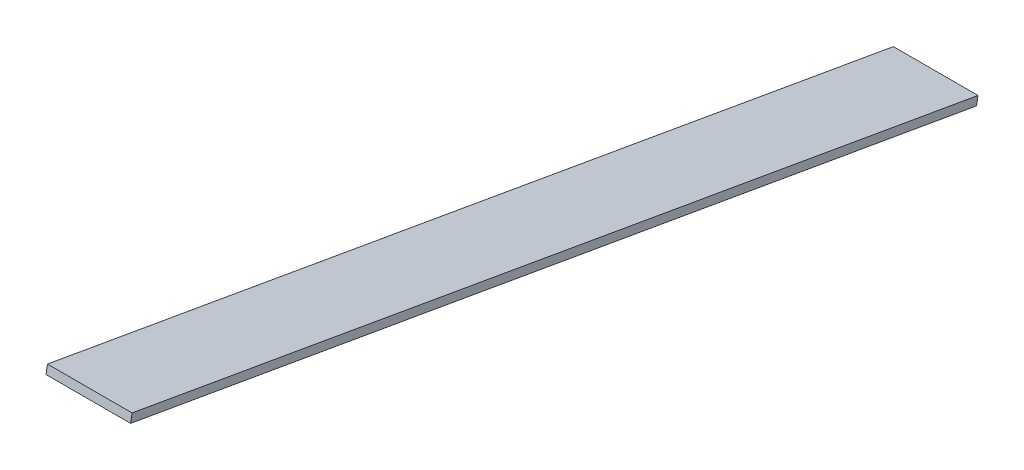
ISO-10303-21;
HEADER;
FILE_DESCRIPTION(('STEP AP214'),'2;1');
FILE_NAME('part.step','',(''),(''),'','','');
FILE_SCHEMA(('AUTOMOTIVE_DESIGN { 1 0 10303 214 1 1 1 1 }'));
ENDSEC;
DATA;
#1=APPLICATION_CONTEXT('core data for automotive mechanical design processes');
#2=APPLICATION_PROTOCOL_DEFINITION('international standard','automotive_design',2000,#1);
#3=PRODUCT_CONTEXT('',#1,'mechanical');
#4=PRODUCT('Part','Part','',(#3));
#5=PRODUCT_RELATED_PRODUCT_CATEGORY('part','',(#4));
#6=PRODUCT_DEFINITION_FORMATION('','',#4);
#7=PRODUCT_DEFINITION_CONTEXT('part definition',#1,'design');
#8=PRODUCT_DEFINITION('design','',#6,#7);
#9=PRODUCT_DEFINITION_SHAPE('','',#8);
#10=(LENGTH_UNIT() NAMED_UNIT(*) SI_UNIT(.MILLI.,.METRE.));
#11=(NAMED_UNIT(*) PLANE_ANGLE_UNIT() SI_UNIT($,.RADIAN.));
#12=(NAMED_UNIT(*) SI_UNIT($,.STERADIAN.) SOLID_ANGLE_UNIT());
#13=UNCERTAINTY_MEASURE_WITH_UNIT(LENGTH_MEASURE(1.E-05),#10,'distance_accuracy_value','');
#14=(GEOMETRIC_REPRESENTATION_CONTEXT(3) GLOBAL_UNCERTAINTY_ASSIGNED_CONTEXT((#13)) GLOBAL_UNIT_ASSIGNED_CONTEXT((#10,
#11,#12)) REPRESENTATION_CONTEXT('',''));
#15=CARTESIAN_POINT('',(0.,0.,0.));
#16=DIRECTION('',(0.,0.,1.));
#17=DIRECTION('',(1.,0.,0.));
#18=AXIS2_PLACEMENT_3D('',#15,#16,#17);
#19=CARTESIAN_POINT('',(19.9999999999997,-96.0598781313774,-0.689521327008837));
#20=DIRECTION('',(-0.999999999999999,0.,0.));
#21=DIRECTION('',(0.,-0.999999999999999,0.));
#22=AXIS2_PLACEMENT_3D('',#19,#20,#21);
#23=PLANE('',#22);
#24=DIRECTION('',(0.,-0.172380331752248,-0.985030467155705));
#25=VECTOR('',#24,1.);
#26=CARTESIAN_POINT('',(19.9999999999998,-100.,0.));
#27=LINE('',#26,#25);
#28=CARTESIAN_POINT('',(19.9999999999998,-30.,399.999999999999));
#29=VERTEX_POINT('',#28);
#30=CARTESIAN_POINT('',(19.9999999999998,-100.,0.));
#31=VERTEX_POINT('',#30);
#32=EDGE_CURVE('E111',#29,#31,#27,.T.);
#33=ORIENTED_EDGE('',*,*,#32,.T.);
#34=DIRECTION('',(0.,-0.985030467155702,0.172380331752248));
#35=VECTOR('',#34,1.);
#36=CARTESIAN_POINT('',(19.9999999999997,-96.0598781313774,-0.689521327008837));
#37=LINE('',#36,#35);
#38=CARTESIAN_POINT('',(19.9999999999997,-96.0598781313774,-0.689521327008837));
#39=VERTEX_POINT('',#38);
#40=EDGE_CURVE('E11',#39,#31,#37,.T.);
#41=ORIENTED_EDGE('',*,*,#40,.F.);
#42=DIRECTION('',(0.,-0.172380331752248,-0.985030467155705));
#43=VECTOR('',#42,1.);
#44=CARTESIAN_POINT('',(19.9999999999997,-96.0598781313774,-0.689521327008837));
#45=LINE('',#44,#43);
#46=CARTESIAN_POINT('',(19.9999999999996,-26.0598781313772,399.31047867299));
#47=VERTEX_POINT('',#46);
#48=EDGE_CURVE('E94',#47,#39,#45,.T.);
#49=ORIENTED_EDGE('',*,*,#48,.F.);
#50=DIRECTION('',(0.,-0.985030467155702,0.172380331752248));
#51=VECTOR('',#50,1.);
#52=CARTESIAN_POINT('',(19.9999999999996,-26.0598781313772,399.31047867299));
#53=LINE('',#52,#51);
#54=EDGE_CURVE('E107',#47,#29,#53,.T.);
#55=ORIENTED_EDGE('',*,*,#54,.T.);
#56=EDGE_LOOP('',(#33,#41,#49,#55));
#57=FACE_BOUND('',#56,.T.);
#58=ADVANCED_FACE('F42',(#57),#23,.F.);
#59=CARTESIAN_POINT('',(19.9999999999997,-96.0598781313774,-0.689521327008837));
#60=DIRECTION('',(0.,0.172380331752248,0.985030467155704));
#61=DIRECTION('',(0.,-0.985030467155703,0.172380331752248));
#62=AXIS2_PLACEMENT_3D('',#59,#60,#61);
#63=PLANE('',#62);
#64=DIRECTION('',(-0.999999999999999,0.,0.));
#65=VECTOR('',#64,1.);
#66=CARTESIAN_POINT('',(19.9999999999998,-100.,0.));
#67=LINE('',#66,#65);
#68=CARTESIAN_POINT('',(-20.0000000000003,-100.,0.));
#69=VERTEX_POINT('',#68);
#70=EDGE_CURVE('E99',#31,#69,#67,.T.);
#71=ORIENTED_EDGE('',*,*,#70,.T.);
#72=DIRECTION('',(0.,-0.985030467155702,0.172380331752248));
#73=VECTOR('',#72,1.);
#74=CARTESIAN_POINT('',(-20.,-96.0598781313771,-0.689521327009557));
#75=LINE('',#74,#73);
#76=CARTESIAN_POINT('',(-20.,-96.0598781313771,-0.689521327009557));
#77=VERTEX_POINT('',#76);
#78=EDGE_CURVE('E51',#77,#69,#75,.T.);
#79=ORIENTED_EDGE('',*,*,#78,.F.);
#80=DIRECTION('',(-0.999999999999999,0.,0.));
#81=VECTOR('',#80,1.);
#82=CARTESIAN_POINT('',(19.9999999999997,-96.0598781313774,-0.689521327008837));
#83=LINE('',#82,#81);
#84=EDGE_CURVE('E89',#39,#77,#83,.T.);
#85=ORIENTED_EDGE('',*,*,#84,.F.);
#86=ORIENTED_EDGE('',*,*,#40,.T.);
#87=EDGE_LOOP('',(#71,#79,#85,#86));
#88=FACE_BOUND('',#87,.T.);
#89=ADVANCED_FACE('F98',(#88),#63,.F.);
#90=CARTESIAN_POINT('',(-20.,-96.0598781313771,-0.689521327009557));
#91=DIRECTION('',(0.999999999999999,0.,0.));
#92=DIRECTION('',(0.,0.999999999999999,0.));
#93=AXIS2_PLACEMENT_3D('',#90,#91,#92);
#94=PLANE('',#93);
#95=DIRECTION('',(0.,0.172380331752248,0.985030467155704));
#96=VECTOR('',#95,1.);
#97=CARTESIAN_POINT('',(-20.0000000000003,-100.,0.));
#98=LINE('',#97,#96);
#99=CARTESIAN_POINT('',(-20.,-30.,399.999999999999));
#100=VERTEX_POINT('',#99);
#101=EDGE_CURVE('E76',#69,#100,#98,.T.);
#102=ORIENTED_EDGE('',*,*,#101,.T.);
#103=DIRECTION('',(0.,-0.985030467155702,0.172380331752248));
#104=VECTOR('',#103,1.);
#105=CARTESIAN_POINT('',(-20.,-26.0598781313772,399.310478672991));
#106=LINE('',#105,#104);
#107=CARTESIAN_POINT('',(-20.,-26.0598781313772,399.310478672991));
#108=VERTEX_POINT('',#107);
#109=EDGE_CURVE('E101',#108,#100,#106,.T.);
#110=ORIENTED_EDGE('',*,*,#109,.F.);
#111=DIRECTION('',(0.,0.172380331752248,0.985030467155704));
#112=VECTOR('',#111,1.);
#113=CARTESIAN_POINT('',(-20.,-96.0598781313771,-0.689521327009557));
#114=LINE('',#113,#112);
#115=EDGE_CURVE('E92',#77,#108,#114,.T.);
#116=ORIENTED_EDGE('',*,*,#115,.F.);
#117=ORIENTED_EDGE('',*,*,#78,.T.);
#118=EDGE_LOOP('',(#102,#110,#116,#117));
#119=FACE_BOUND('',#118,.T.);
#120=ADVANCED_FACE('F102',(#119),#94,.F.);
#121=CARTESIAN_POINT('',(19.9999999999996,-26.0598781313772,399.31047867299));
#122=DIRECTION('',(0.,-0.172380331752248,-0.985030467155704));
#123=DIRECTION('',(0.,0.985030467155703,-0.172380331752248));
#124=AXIS2_PLACEMENT_3D('',#121,#122,#123);
#125=PLANE('',#124);
#126=DIRECTION('',(1.,0.,0.));
#127=VECTOR('',#126,1.);
#128=CARTESIAN_POINT('',(19.9999999999998,-30.,399.999999999999));
#129=LINE('',#128,#127);
#130=EDGE_CURVE('E82',#100,#29,#129,.T.);
#131=ORIENTED_EDGE('',*,*,#130,.T.);
#132=ORIENTED_EDGE('',*,*,#54,.F.);
#133=DIRECTION('',(1.,0.,0.));
#134=VECTOR('',#133,1.);
#135=CARTESIAN_POINT('',(19.9999999999996,-26.0598781313772,399.31047867299));
#136=LINE('',#135,#134);
#137=EDGE_CURVE('E59',#108,#47,#136,.T.);
#138=ORIENTED_EDGE('',*,*,#137,.F.);
#139=ORIENTED_EDGE('',*,*,#109,.T.);
#140=EDGE_LOOP('',(#131,#132,#138,#139));
#141=FACE_BOUND('',#140,.T.);
#142=ADVANCED_FACE('F126',(#141),#125,.F.);
#143=CARTESIAN_POINT('',(0.,-93.0883802538757,16.2904665444281));
#144=DIRECTION('',(0.,-0.985030467155702,0.172380331752248));
#145=DIRECTION('',(0.,-0.172380331752248,-0.985030467155704));
#146=AXIS2_PLACEMENT_3D('',#143,#144,#145);
#147=PLANE('',#146);
#148=ORIENTED_EDGE('',*,*,#48,.T.);
#149=ORIENTED_EDGE('',*,*,#84,.T.);
#150=ORIENTED_EDGE('',*,*,#115,.T.);
#151=ORIENTED_EDGE('',*,*,#137,.T.);
#152=EDGE_LOOP('',(#148,#149,#150,#151));
#153=FACE_BOUND('',#152,.T.);
#154=ADVANCED_FACE('F90',(#153),#147,.F.);
#155=CARTESIAN_POINT('',(0.,-97.0285021224984,16.9799878714369));
#156=DIRECTION('',(0.,-0.985030467155702,0.172380331752248));
#157=DIRECTION('',(0.,-0.172380331752248,-0.985030467155704));
#158=AXIS2_PLACEMENT_3D('',#155,#156,#157);
#159=PLANE('',#158);
#160=ORIENTED_EDGE('',*,*,#32,.F.);
#161=ORIENTED_EDGE('',*,*,#130,.F.);
#162=ORIENTED_EDGE('',*,*,#101,.F.);
#163=ORIENTED_EDGE('',*,*,#70,.F.);
#164=EDGE_LOOP('',(#160,#161,#162,#163));
#165=FACE_BOUND('',#164,.T.);
#166=ADVANCED_FACE('F129',(#165),#159,.T.);
#167=CLOSED_SHELL('',(#58,#89,#120,#142,#154,#166));
#168=MANIFOLD_SOLID_BREP('B2',#167);
#169=ADVANCED_BREP_SHAPE_REPRESENTATION('',(#18,#168),#14);
#170=SHAPE_DEFINITION_REPRESENTATION(#9,#169);
ENDSEC;
END-ISO-10303-21;
